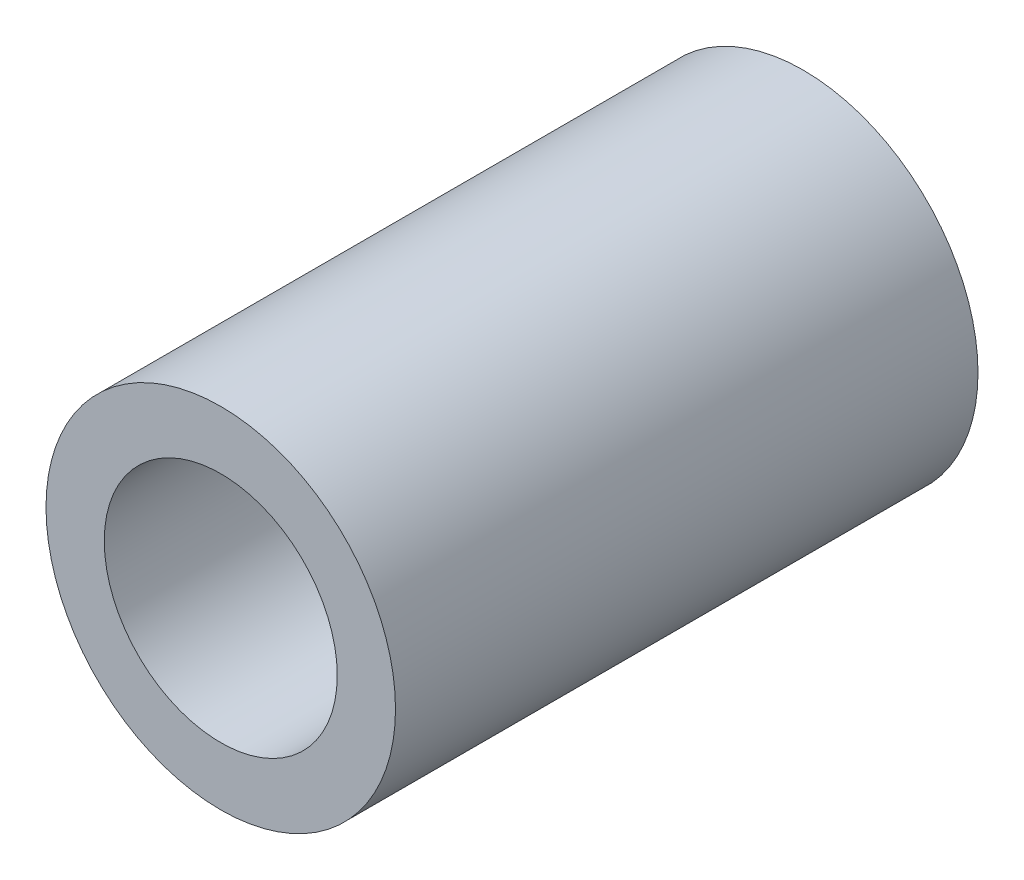
ISO-10303-21;
HEADER;
FILE_DESCRIPTION(('STEP AP214'),'2;1');
FILE_NAME('part.step','',(''),(''),'','','');
FILE_SCHEMA(('AUTOMOTIVE_DESIGN { 1 0 10303 214 1 1 1 1 }'));
ENDSEC;
DATA;
#1=APPLICATION_CONTEXT('core data for automotive mechanical design processes');
#2=APPLICATION_PROTOCOL_DEFINITION('international standard','automotive_design',2000,#1);
#3=PRODUCT_CONTEXT('',#1,'mechanical');
#4=PRODUCT('Part','Part','',(#3));
#5=PRODUCT_RELATED_PRODUCT_CATEGORY('part','',(#4));
#6=PRODUCT_DEFINITION_FORMATION('','',#4);
#7=PRODUCT_DEFINITION_CONTEXT('part definition',#1,'design');
#8=PRODUCT_DEFINITION('design','',#6,#7);
#9=PRODUCT_DEFINITION_SHAPE('','',#8);
#10=(LENGTH_UNIT() NAMED_UNIT(*) SI_UNIT(.MILLI.,.METRE.));
#11=(NAMED_UNIT(*) PLANE_ANGLE_UNIT() SI_UNIT($,.RADIAN.));
#12=(NAMED_UNIT(*) SI_UNIT($,.STERADIAN.) SOLID_ANGLE_UNIT());
#13=UNCERTAINTY_MEASURE_WITH_UNIT(LENGTH_MEASURE(1.E-05),#10,'distance_accuracy_value','');
#14=(GEOMETRIC_REPRESENTATION_CONTEXT(3) GLOBAL_UNCERTAINTY_ASSIGNED_CONTEXT((#13)) GLOBAL_UNIT_ASSIGNED_CONTEXT((#10,
#11,#12)) REPRESENTATION_CONTEXT('',''));
#15=CARTESIAN_POINT('',(0.,0.,0.));
#16=DIRECTION('',(0.,0.,1.));
#17=DIRECTION('',(1.,0.,0.));
#18=AXIS2_PLACEMENT_3D('',#15,#16,#17);
#19=CARTESIAN_POINT('',(0.,0.,10.));
#20=DIRECTION('',(0.,0.,1.));
#21=DIRECTION('',(1.,0.,0.));
#22=AXIS2_PLACEMENT_3D('',#19,#20,#21);
#23=PLANE('',#22);
#24=CARTESIAN_POINT('',(0.,0.,10.));
#25=DIRECTION('',(0.,0.,1.));
#26=DIRECTION('',(1.,0.,0.));
#27=AXIS2_PLACEMENT_3D('',#24,#25,#26);
#28=CIRCLE('',#27,3.);
#29=CARTESIAN_POINT('',(3.,0.,10.));
#30=VERTEX_POINT('',#29);
#31=EDGE_CURVE('E10',#30,#30,#28,.T.);
#32=ORIENTED_EDGE('',*,*,#31,.T.);
#33=EDGE_LOOP('',(#32));
#34=FACE_BOUND('',#33,.T.);
#35=CARTESIAN_POINT('',(0.,0.,10.));
#36=DIRECTION('',(0.,0.,1.));
#37=DIRECTION('',(1.,0.,0.));
#38=AXIS2_PLACEMENT_3D('',#35,#36,#37);
#39=CIRCLE('',#38,2.);
#40=CARTESIAN_POINT('',(2.,0.,10.));
#41=VERTEX_POINT('',#40);
#42=EDGE_CURVE('E35',#41,#41,#39,.T.);
#43=ORIENTED_EDGE('',*,*,#42,.F.);
#44=EDGE_LOOP('',(#43));
#45=FACE_BOUND('',#44,.T.);
#46=ADVANCED_FACE('F24',(#34,#45),#23,.T.);
#47=CARTESIAN_POINT('',(0.,0.,0.));
#48=DIRECTION('',(0.,0.,1.));
#49=DIRECTION('',(1.,0.,0.));
#50=AXIS2_PLACEMENT_3D('',#47,#48,#49);
#51=PLANE('',#50);
#52=CARTESIAN_POINT('',(0.,0.,0.));
#53=DIRECTION('',(0.,0.,1.));
#54=DIRECTION('',(1.,0.,0.));
#55=AXIS2_PLACEMENT_3D('',#52,#53,#54);
#56=CIRCLE('',#55,3.);
#57=CARTESIAN_POINT('',(3.,0.,0.));
#58=VERTEX_POINT('',#57);
#59=EDGE_CURVE('E31',#58,#58,#56,.T.);
#60=ORIENTED_EDGE('',*,*,#59,.F.);
#61=EDGE_LOOP('',(#60));
#62=FACE_BOUND('',#61,.T.);
#63=CARTESIAN_POINT('',(0.,0.,0.));
#64=DIRECTION('',(0.,0.,1.));
#65=DIRECTION('',(1.,0.,0.));
#66=AXIS2_PLACEMENT_3D('',#63,#64,#65);
#67=CIRCLE('',#66,2.);
#68=CARTESIAN_POINT('',(2.,0.,0.));
#69=VERTEX_POINT('',#68);
#70=EDGE_CURVE('E39',#69,#69,#67,.T.);
#71=ORIENTED_EDGE('',*,*,#70,.T.);
#72=EDGE_LOOP('',(#71));
#73=FACE_BOUND('',#72,.T.);
#74=ADVANCED_FACE('F45',(#62,#73),#51,.F.);
#75=CARTESIAN_POINT('',(0.,0.,10.));
#76=DIRECTION('',(0.,0.,-1.));
#77=DIRECTION('',(-1.,0.,0.));
#78=AXIS2_PLACEMENT_3D('',#75,#76,#77);
#79=CYLINDRICAL_SURFACE('',#78,3.);
#80=ORIENTED_EDGE('',*,*,#31,.F.);
#81=EDGE_LOOP('',(#80));
#82=FACE_BOUND('',#81,.T.);
#83=ORIENTED_EDGE('',*,*,#59,.T.);
#84=EDGE_LOOP('',(#83));
#85=FACE_BOUND('',#84,.T.);
#86=ADVANCED_FACE('F26',(#82,#85),#79,.T.);
#87=CARTESIAN_POINT('',(0.,0.,10.));
#88=DIRECTION('',(0.,0.,-1.));
#89=DIRECTION('',(-1.,0.,0.));
#90=AXIS2_PLACEMENT_3D('',#87,#88,#89);
#91=CYLINDRICAL_SURFACE('',#90,2.);
#92=ORIENTED_EDGE('',*,*,#42,.T.);
#93=EDGE_LOOP('',(#92));
#94=FACE_BOUND('',#93,.T.);
#95=ORIENTED_EDGE('',*,*,#70,.F.);
#96=EDGE_LOOP('',(#95));
#97=FACE_BOUND('',#96,.T.);
#98=ADVANCED_FACE('F47',(#94,#97),#91,.F.);
#99=CLOSED_SHELL('',(#46,#74,#86,#98));
#100=MANIFOLD_SOLID_BREP('B2',#99);
#101=ADVANCED_BREP_SHAPE_REPRESENTATION('',(#18,#100),#14);
#102=SHAPE_DEFINITION_REPRESENTATION(#9,#101);
ENDSEC;
END-ISO-10303-21;
